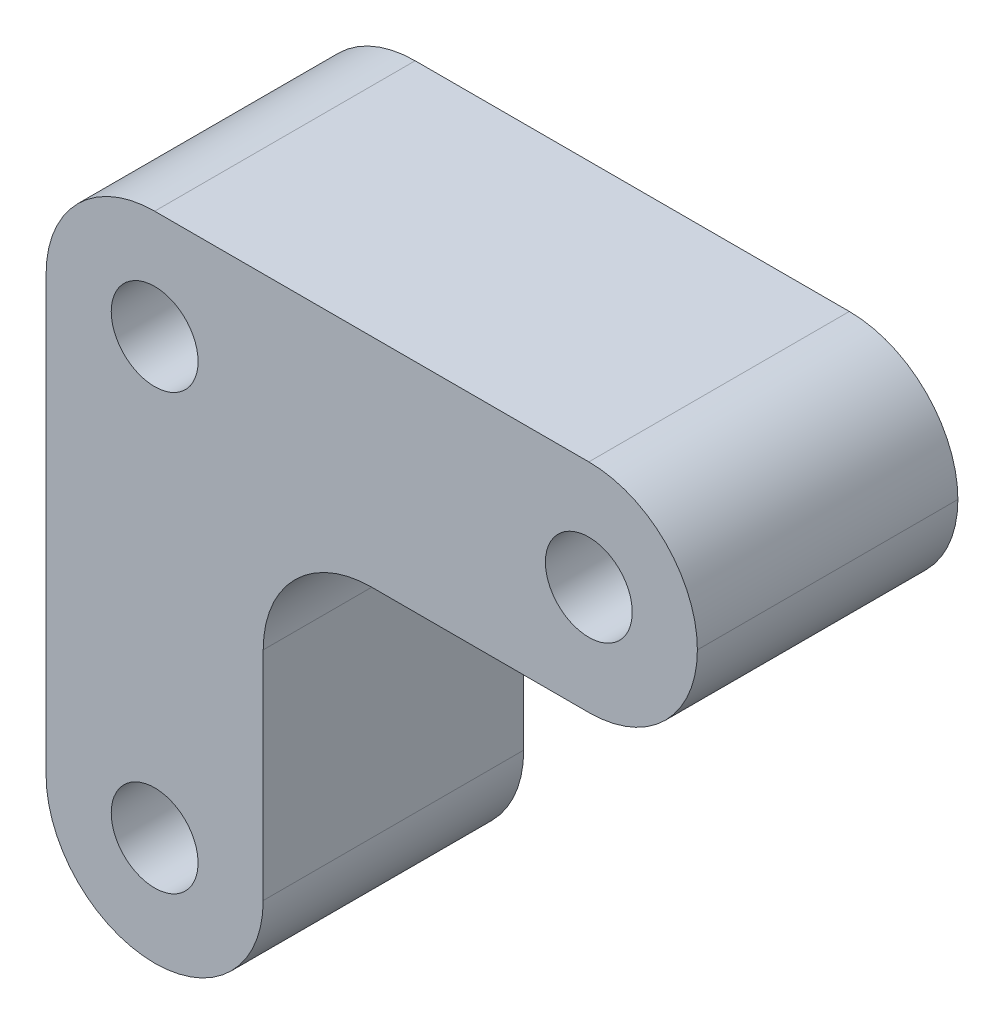
ISO-10303-21;
HEADER;
FILE_DESCRIPTION(('STEP AP214'),'2;1');
FILE_NAME('part.step','',(''),(''),'','','');
FILE_SCHEMA(('AUTOMOTIVE_DESIGN { 1 0 10303 214 1 1 1 1 }'));
ENDSEC;
DATA;
#1=APPLICATION_CONTEXT('core data for automotive mechanical design processes');
#2=APPLICATION_PROTOCOL_DEFINITION('international standard','automotive_design',2000,#1);
#3=PRODUCT_CONTEXT('',#1,'mechanical');
#4=PRODUCT('Part','Part','',(#3));
#5=PRODUCT_RELATED_PRODUCT_CATEGORY('part','',(#4));
#6=PRODUCT_DEFINITION_FORMATION('','',#4);
#7=PRODUCT_DEFINITION_CONTEXT('part definition',#1,'design');
#8=PRODUCT_DEFINITION('design','',#6,#7);
#9=PRODUCT_DEFINITION_SHAPE('','',#8);
#10=(LENGTH_UNIT() NAMED_UNIT(*) SI_UNIT(.MILLI.,.METRE.));
#11=(NAMED_UNIT(*) PLANE_ANGLE_UNIT() SI_UNIT($,.RADIAN.));
#12=(NAMED_UNIT(*) SI_UNIT($,.STERADIAN.) SOLID_ANGLE_UNIT());
#13=UNCERTAINTY_MEASURE_WITH_UNIT(LENGTH_MEASURE(1.E-05),#10,'distance_accuracy_value','');
#14=(GEOMETRIC_REPRESENTATION_CONTEXT(3) GLOBAL_UNCERTAINTY_ASSIGNED_CONTEXT((#13)) GLOBAL_UNIT_ASSIGNED_CONTEXT((#10,
#11,#12)) REPRESENTATION_CONTEXT('',''));
#15=CARTESIAN_POINT('',(0.,0.,0.));
#16=DIRECTION('',(0.,0.,1.));
#17=DIRECTION('',(1.,0.,0.));
#18=AXIS2_PLACEMENT_3D('',#15,#16,#17);
#19=CARTESIAN_POINT('',(0.,0.,12.));
#20=DIRECTION('',(1.,0.,0.));
#21=DIRECTION('',(0.,0.,-1.));
#22=AXIS2_PLACEMENT_3D('',#19,#20,#21);
#23=PLANE('',#22);
#24=DIRECTION('',(0.,-1.,0.));
#25=VECTOR('',#24,1.);
#26=CARTESIAN_POINT('',(0.,0.,12.));
#27=LINE('',#26,#25);
#28=CARTESIAN_POINT('',(0.,25.,12.));
#29=VERTEX_POINT('',#28);
#30=CARTESIAN_POINT('',(0.,5.,12.));
#31=VERTEX_POINT('',#30);
#32=EDGE_CURVE('E212',#29,#31,#27,.T.);
#33=ORIENTED_EDGE('',*,*,#32,.F.);
#34=DIRECTION('',(0.,0.,-1.));
#35=VECTOR('',#34,1.);
#36=CARTESIAN_POINT('',(0.,25.,12.));
#37=LINE('',#36,#35);
#38=CARTESIAN_POINT('',(0.,25.,0.));
#39=VERTEX_POINT('',#38);
#40=EDGE_CURVE('E145',#29,#39,#37,.T.);
#41=ORIENTED_EDGE('',*,*,#40,.T.);
#42=DIRECTION('',(0.,-1.,0.));
#43=VECTOR('',#42,1.);
#44=CARTESIAN_POINT('',(0.,0.,0.));
#45=LINE('',#44,#43);
#46=CARTESIAN_POINT('',(0.,5.,0.));
#47=VERTEX_POINT('',#46);
#48=EDGE_CURVE('E211',#39,#47,#45,.T.);
#49=ORIENTED_EDGE('',*,*,#48,.T.);
#50=DIRECTION('',(0.,0.,-1.));
#51=VECTOR('',#50,1.);
#52=CARTESIAN_POINT('',(0.,5.,12.));
#53=LINE('',#52,#51);
#54=EDGE_CURVE('E142',#47,#31,#53,.F.);
#55=ORIENTED_EDGE('',*,*,#54,.T.);
#56=EDGE_LOOP('',(#33,#41,#49,#55));
#57=FACE_BOUND('',#56,.T.);
#58=ADVANCED_FACE('F32',(#57),#23,.F.);
#59=CARTESIAN_POINT('',(0.,30.,12.));
#60=DIRECTION('',(0.,-1.,0.));
#61=DIRECTION('',(0.,0.,-1.));
#62=AXIS2_PLACEMENT_3D('',#59,#60,#61);
#63=PLANE('',#62);
#64=DIRECTION('',(-1.,0.,0.));
#65=VECTOR('',#64,1.);
#66=CARTESIAN_POINT('',(0.,30.,0.));
#67=LINE('',#66,#65);
#68=CARTESIAN_POINT('',(25.,30.,0.));
#69=VERTEX_POINT('',#68);
#70=CARTESIAN_POINT('',(5.,30.,0.));
#71=VERTEX_POINT('',#70);
#72=EDGE_CURVE('E214',#69,#71,#67,.T.);
#73=ORIENTED_EDGE('',*,*,#72,.T.);
#74=DIRECTION('',(0.,0.,-1.));
#75=VECTOR('',#74,1.);
#76=CARTESIAN_POINT('',(5.,30.,12.));
#77=LINE('',#76,#75);
#78=CARTESIAN_POINT('',(5.,30.,12.));
#79=VERTEX_POINT('',#78);
#80=EDGE_CURVE('E161',#71,#79,#77,.F.);
#81=ORIENTED_EDGE('',*,*,#80,.T.);
#82=DIRECTION('',(-1.,0.,0.));
#83=VECTOR('',#82,1.);
#84=CARTESIAN_POINT('',(0.,30.,12.));
#85=LINE('',#84,#83);
#86=CARTESIAN_POINT('',(25.,30.,12.));
#87=VERTEX_POINT('',#86);
#88=EDGE_CURVE('E137',#87,#79,#85,.T.);
#89=ORIENTED_EDGE('',*,*,#88,.F.);
#90=DIRECTION('',(0.,0.,-1.));
#91=VECTOR('',#90,1.);
#92=CARTESIAN_POINT('',(25.,30.,12.));
#93=LINE('',#92,#91);
#94=EDGE_CURVE('E158',#87,#69,#93,.T.);
#95=ORIENTED_EDGE('',*,*,#94,.T.);
#96=EDGE_LOOP('',(#73,#81,#89,#95));
#97=FACE_BOUND('',#96,.T.);
#98=ADVANCED_FACE('F221',(#97),#63,.F.);
#99=CARTESIAN_POINT('',(0.,0.,12.));
#100=DIRECTION('',(0.,0.,-1.));
#101=DIRECTION('',(-1.,0.,0.));
#102=AXIS2_PLACEMENT_3D('',#99,#100,#101);
#103=PLANE('',#102);
#104=CARTESIAN_POINT('',(25.,25.,12.));
#105=DIRECTION('',(0.,0.,-1.));
#106=DIRECTION('',(-1.,0.,0.));
#107=AXIS2_PLACEMENT_3D('',#104,#105,#106);
#108=CIRCLE('',#107,2.00000000000001);
#109=CARTESIAN_POINT('',(23.,25.,12.));
#110=VERTEX_POINT('',#109);
#111=EDGE_CURVE('E202',#110,#110,#108,.T.);
#112=ORIENTED_EDGE('',*,*,#111,.T.);
#113=EDGE_LOOP('',(#112));
#114=FACE_BOUND('',#113,.T.);
#115=CARTESIAN_POINT('',(4.99999999999999,5.,12.));
#116=DIRECTION('',(0.,0.,-1.));
#117=DIRECTION('',(-1.,0.,0.));
#118=AXIS2_PLACEMENT_3D('',#115,#116,#117);
#119=CIRCLE('',#118,2.);
#120=CARTESIAN_POINT('',(2.99999999999999,5.,12.));
#121=VERTEX_POINT('',#120);
#122=EDGE_CURVE('E197',#121,#121,#119,.T.);
#123=ORIENTED_EDGE('',*,*,#122,.T.);
#124=EDGE_LOOP('',(#123));
#125=FACE_BOUND('',#124,.T.);
#126=CARTESIAN_POINT('',(5.,25.,12.));
#127=DIRECTION('',(0.,0.,-1.));
#128=DIRECTION('',(-1.,0.,0.));
#129=AXIS2_PLACEMENT_3D('',#126,#127,#128);
#130=CIRCLE('',#129,2.);
#131=CARTESIAN_POINT('',(3.,25.,12.));
#132=VERTEX_POINT('',#131);
#133=EDGE_CURVE('E208',#132,#132,#130,.T.);
#134=ORIENTED_EDGE('',*,*,#133,.T.);
#135=EDGE_LOOP('',(#134));
#136=FACE_BOUND('',#135,.T.);
#137=ORIENTED_EDGE('',*,*,#88,.T.);
#138=CARTESIAN_POINT('',(5.,25.,12.));
#139=DIRECTION('',(0.,0.,-1.));
#140=DIRECTION('',(-1.,0.,0.));
#141=AXIS2_PLACEMENT_3D('',#138,#139,#140);
#142=CIRCLE('',#141,5.);
#143=EDGE_CURVE('E169',#79,#29,#142,.F.);
#144=ORIENTED_EDGE('',*,*,#143,.T.);
#145=ORIENTED_EDGE('',*,*,#32,.T.);
#146=CARTESIAN_POINT('',(5.,5.,12.));
#147=DIRECTION('',(0.,0.,-1.));
#148=DIRECTION('',(-1.,0.,0.));
#149=AXIS2_PLACEMENT_3D('',#146,#147,#148);
#150=CIRCLE('',#149,5.);
#151=CARTESIAN_POINT('',(5.,0.,12.));
#152=VERTEX_POINT('',#151);
#153=EDGE_CURVE('E56',#31,#152,#150,.F.);
#154=ORIENTED_EDGE('',*,*,#153,.T.);
#155=CARTESIAN_POINT('',(5.,5.,12.));
#156=DIRECTION('',(0.,0.,-1.));
#157=DIRECTION('',(-1.,0.,0.));
#158=AXIS2_PLACEMENT_3D('',#155,#156,#157);
#159=CIRCLE('',#158,5.);
#160=CARTESIAN_POINT('',(10.,5.,12.));
#161=VERTEX_POINT('',#160);
#162=EDGE_CURVE('E166',#152,#161,#159,.F.);
#163=ORIENTED_EDGE('',*,*,#162,.T.);
#164=DIRECTION('',(0.,1.,0.));
#165=VECTOR('',#164,1.);
#166=CARTESIAN_POINT('',(10.,0.,12.));
#167=LINE('',#166,#165);
#168=CARTESIAN_POINT('',(10.,15.,12.));
#169=VERTEX_POINT('',#168);
#170=EDGE_CURVE('E189',#161,#169,#167,.T.);
#171=ORIENTED_EDGE('',*,*,#170,.T.);
#172=CARTESIAN_POINT('',(15.,15.,12.));
#173=DIRECTION('',(0.,0.,-1.));
#174=DIRECTION('',(-1.,0.,0.));
#175=AXIS2_PLACEMENT_3D('',#172,#173,#174);
#176=CIRCLE('',#175,5.);
#177=CARTESIAN_POINT('',(15.,20.,12.));
#178=VERTEX_POINT('',#177);
#179=EDGE_CURVE('E41',#169,#178,#176,.T.);
#180=ORIENTED_EDGE('',*,*,#179,.T.);
#181=DIRECTION('',(1.,0.,0.));
#182=VECTOR('',#181,1.);
#183=CARTESIAN_POINT('',(0.,20.,12.));
#184=LINE('',#183,#182);
#185=CARTESIAN_POINT('',(25.,20.,12.));
#186=VERTEX_POINT('',#185);
#187=EDGE_CURVE('E130',#178,#186,#184,.T.);
#188=ORIENTED_EDGE('',*,*,#187,.T.);
#189=CARTESIAN_POINT('',(25.,25.,12.));
#190=DIRECTION('',(0.,0.,-1.));
#191=DIRECTION('',(-1.,0.,0.));
#192=AXIS2_PLACEMENT_3D('',#189,#190,#191);
#193=CIRCLE('',#192,5.);
#194=CARTESIAN_POINT('',(30.,25.,12.));
#195=VERTEX_POINT('',#194);
#196=EDGE_CURVE('E49',#186,#195,#193,.F.);
#197=ORIENTED_EDGE('',*,*,#196,.T.);
#198=CARTESIAN_POINT('',(25.,25.,12.));
#199=DIRECTION('',(0.,0.,-1.));
#200=DIRECTION('',(-1.,0.,0.));
#201=AXIS2_PLACEMENT_3D('',#198,#199,#200);
#202=CIRCLE('',#201,5.);
#203=EDGE_CURVE('E164',#195,#87,#202,.F.);
#204=ORIENTED_EDGE('',*,*,#203,.T.);
#205=EDGE_LOOP('',(#137,#144,#145,#154,#163,#171,#180,#188,#197,#204));
#206=FACE_BOUND('',#205,.T.);
#207=ADVANCED_FACE('F228',(#114,#125,#136,#206),#103,.F.);
#208=CARTESIAN_POINT('',(0.,0.,0.));
#209=DIRECTION('',(0.,0.,-1.));
#210=DIRECTION('',(-1.,0.,0.));
#211=AXIS2_PLACEMENT_3D('',#208,#209,#210);
#212=PLANE('',#211);
#213=ORIENTED_EDGE('',*,*,#48,.F.);
#214=CARTESIAN_POINT('',(5.,25.,0.));
#215=DIRECTION('',(0.,0.,-1.));
#216=DIRECTION('',(-1.,0.,0.));
#217=AXIS2_PLACEMENT_3D('',#214,#215,#216);
#218=CIRCLE('',#217,5.);
#219=EDGE_CURVE('E156',#39,#71,#218,.T.);
#220=ORIENTED_EDGE('',*,*,#219,.T.);
#221=ORIENTED_EDGE('',*,*,#72,.F.);
#222=CARTESIAN_POINT('',(25.,25.,0.));
#223=DIRECTION('',(0.,0.,-1.));
#224=DIRECTION('',(-1.,0.,0.));
#225=AXIS2_PLACEMENT_3D('',#222,#223,#224);
#226=CIRCLE('',#225,5.);
#227=CARTESIAN_POINT('',(30.,25.,0.));
#228=VERTEX_POINT('',#227);
#229=EDGE_CURVE('E150',#69,#228,#226,.T.);
#230=ORIENTED_EDGE('',*,*,#229,.T.);
#231=CARTESIAN_POINT('',(25.,25.,0.));
#232=DIRECTION('',(0.,0.,-1.));
#233=DIRECTION('',(-1.,0.,0.));
#234=AXIS2_PLACEMENT_3D('',#231,#232,#233);
#235=CIRCLE('',#234,5.);
#236=CARTESIAN_POINT('',(25.,20.,0.));
#237=VERTEX_POINT('',#236);
#238=EDGE_CURVE('E148',#228,#237,#235,.T.);
#239=ORIENTED_EDGE('',*,*,#238,.T.);
#240=DIRECTION('',(-1.,0.,0.));
#241=VECTOR('',#240,1.);
#242=CARTESIAN_POINT('',(30.,20.,0.));
#243=LINE('',#242,#241);
#244=CARTESIAN_POINT('',(15.,20.,0.));
#245=VERTEX_POINT('',#244);
#246=EDGE_CURVE('E118',#237,#245,#243,.T.);
#247=ORIENTED_EDGE('',*,*,#246,.T.);
#248=CARTESIAN_POINT('',(15.,15.,0.));
#249=DIRECTION('',(0.,0.,-1.));
#250=DIRECTION('',(-1.,0.,0.));
#251=AXIS2_PLACEMENT_3D('',#248,#249,#250);
#252=CIRCLE('',#251,5.);
#253=CARTESIAN_POINT('',(10.,15.,0.));
#254=VERTEX_POINT('',#253);
#255=EDGE_CURVE('E11',#245,#254,#252,.F.);
#256=ORIENTED_EDGE('',*,*,#255,.T.);
#257=DIRECTION('',(0.,-1.,0.));
#258=VECTOR('',#257,1.);
#259=CARTESIAN_POINT('',(10.,0.,0.));
#260=LINE('',#259,#258);
#261=CARTESIAN_POINT('',(10.,5.,0.));
#262=VERTEX_POINT('',#261);
#263=EDGE_CURVE('E115',#254,#262,#260,.T.);
#264=ORIENTED_EDGE('',*,*,#263,.T.);
#265=CARTESIAN_POINT('',(5.,5.,0.));
#266=DIRECTION('',(0.,0.,-1.));
#267=DIRECTION('',(-1.,0.,0.));
#268=AXIS2_PLACEMENT_3D('',#265,#266,#267);
#269=CIRCLE('',#268,5.);
#270=CARTESIAN_POINT('',(5.,0.,0.));
#271=VERTEX_POINT('',#270);
#272=EDGE_CURVE('E152',#262,#271,#269,.T.);
#273=ORIENTED_EDGE('',*,*,#272,.T.);
#274=CARTESIAN_POINT('',(5.,5.,0.));
#275=DIRECTION('',(0.,0.,-1.));
#276=DIRECTION('',(-1.,0.,0.));
#277=AXIS2_PLACEMENT_3D('',#274,#275,#276);
#278=CIRCLE('',#277,5.);
#279=EDGE_CURVE('E154',#271,#47,#278,.T.);
#280=ORIENTED_EDGE('',*,*,#279,.T.);
#281=EDGE_LOOP('',(#213,#220,#221,#230,#239,#247,#256,#264,#273,#280));
#282=FACE_BOUND('',#281,.T.);
#283=CARTESIAN_POINT('',(25.,25.,0.));
#284=DIRECTION('',(0.,0.,1.));
#285=DIRECTION('',(-1.,0.,0.));
#286=AXIS2_PLACEMENT_3D('',#283,#284,#285);
#287=CIRCLE('',#286,2.00000000000001);
#288=CARTESIAN_POINT('',(23.,25.,0.));
#289=VERTEX_POINT('',#288);
#290=EDGE_CURVE('E194',#289,#289,#287,.T.);
#291=ORIENTED_EDGE('',*,*,#290,.T.);
#292=EDGE_LOOP('',(#291));
#293=FACE_BOUND('',#292,.T.);
#294=CARTESIAN_POINT('',(4.99999999999999,5.,0.));
#295=DIRECTION('',(0.,0.,1.));
#296=DIRECTION('',(-1.,0.,0.));
#297=AXIS2_PLACEMENT_3D('',#294,#295,#296);
#298=CIRCLE('',#297,2.);
#299=CARTESIAN_POINT('',(2.99999999999999,5.,0.));
#300=VERTEX_POINT('',#299);
#301=EDGE_CURVE('E191',#300,#300,#298,.T.);
#302=ORIENTED_EDGE('',*,*,#301,.T.);
#303=EDGE_LOOP('',(#302));
#304=FACE_BOUND('',#303,.T.);
#305=CARTESIAN_POINT('',(5.,25.,0.));
#306=DIRECTION('',(0.,0.,1.));
#307=DIRECTION('',(1.,0.,0.));
#308=AXIS2_PLACEMENT_3D('',#305,#306,#307);
#309=CIRCLE('',#308,2.);
#310=CARTESIAN_POINT('',(7.,25.,0.));
#311=VERTEX_POINT('',#310);
#312=EDGE_CURVE('E205',#311,#311,#309,.T.);
#313=ORIENTED_EDGE('',*,*,#312,.T.);
#314=EDGE_LOOP('',(#313));
#315=FACE_BOUND('',#314,.T.);
#316=ADVANCED_FACE('F113',(#282,#293,#304,#315),#212,.T.);
#317=CARTESIAN_POINT('',(5.,25.,0.));
#318=DIRECTION('',(0.,0.,1.));
#319=DIRECTION('',(1.,0.,0.));
#320=AXIS2_PLACEMENT_3D('',#317,#318,#319);
#321=CYLINDRICAL_SURFACE('',#320,2.);
#322=ORIENTED_EDGE('',*,*,#312,.F.);
#323=EDGE_LOOP('',(#322));
#324=FACE_BOUND('',#323,.T.);
#325=ORIENTED_EDGE('',*,*,#133,.F.);
#326=EDGE_LOOP('',(#325));
#327=FACE_BOUND('',#326,.T.);
#328=ADVANCED_FACE('F267',(#324,#327),#321,.F.);
#329=CARTESIAN_POINT('',(4.99999999999999,5.,0.));
#330=DIRECTION('',(0.,0.,1.));
#331=DIRECTION('',(1.,0.,0.));
#332=AXIS2_PLACEMENT_3D('',#329,#330,#331);
#333=CYLINDRICAL_SURFACE('',#332,2.);
#334=ORIENTED_EDGE('',*,*,#301,.F.);
#335=EDGE_LOOP('',(#334));
#336=FACE_BOUND('',#335,.T.);
#337=ORIENTED_EDGE('',*,*,#122,.F.);
#338=EDGE_LOOP('',(#337));
#339=FACE_BOUND('',#338,.T.);
#340=ADVANCED_FACE('F263',(#336,#339),#333,.F.);
#341=CARTESIAN_POINT('',(25.,25.,0.));
#342=DIRECTION('',(0.,0.,1.));
#343=DIRECTION('',(1.,0.,0.));
#344=AXIS2_PLACEMENT_3D('',#341,#342,#343);
#345=CYLINDRICAL_SURFACE('',#344,2.00000000000001);
#346=ORIENTED_EDGE('',*,*,#290,.F.);
#347=EDGE_LOOP('',(#346));
#348=FACE_BOUND('',#347,.T.);
#349=ORIENTED_EDGE('',*,*,#111,.F.);
#350=EDGE_LOOP('',(#349));
#351=FACE_BOUND('',#350,.T.);
#352=ADVANCED_FACE('F258',(#348,#351),#345,.F.);
#353=CARTESIAN_POINT('',(10.,0.,0.));
#354=DIRECTION('',(-1.,0.,0.));
#355=DIRECTION('',(0.,-1.,0.));
#356=AXIS2_PLACEMENT_3D('',#353,#354,#355);
#357=PLANE('',#356);
#358=ORIENTED_EDGE('',*,*,#263,.F.);
#359=DIRECTION('',(0.,0.,1.));
#360=VECTOR('',#359,1.);
#361=CARTESIAN_POINT('',(10.,15.,12.));
#362=LINE('',#361,#360);
#363=EDGE_CURVE('E126',#254,#169,#362,.T.);
#364=ORIENTED_EDGE('',*,*,#363,.T.);
#365=ORIENTED_EDGE('',*,*,#170,.F.);
#366=DIRECTION('',(0.,0.,1.));
#367=VECTOR('',#366,1.);
#368=CARTESIAN_POINT('',(10.,5.,0.));
#369=LINE('',#368,#367);
#370=EDGE_CURVE('E129',#161,#262,#369,.F.);
#371=ORIENTED_EDGE('',*,*,#370,.T.);
#372=EDGE_LOOP('',(#358,#364,#365,#371));
#373=FACE_BOUND('',#372,.T.);
#374=ADVANCED_FACE('F124',(#373),#357,.F.);
#375=CARTESIAN_POINT('',(30.,20.,0.));
#376=DIRECTION('',(0.,1.,0.));
#377=DIRECTION('',(-1.,0.,0.));
#378=AXIS2_PLACEMENT_3D('',#375,#376,#377);
#379=PLANE('',#378);
#380=ORIENTED_EDGE('',*,*,#187,.F.);
#381=DIRECTION('',(0.,0.,1.));
#382=VECTOR('',#381,1.);
#383=CARTESIAN_POINT('',(15.,20.,0.));
#384=LINE('',#383,#382);
#385=EDGE_CURVE('E135',#178,#245,#384,.F.);
#386=ORIENTED_EDGE('',*,*,#385,.T.);
#387=ORIENTED_EDGE('',*,*,#246,.F.);
#388=DIRECTION('',(0.,0.,1.));
#389=VECTOR('',#388,1.);
#390=CARTESIAN_POINT('',(25.,20.,0.));
#391=LINE('',#390,#389);
#392=EDGE_CURVE('E133',#237,#186,#391,.T.);
#393=ORIENTED_EDGE('',*,*,#392,.T.);
#394=EDGE_LOOP('',(#380,#386,#387,#393));
#395=FACE_BOUND('',#394,.T.);
#396=ADVANCED_FACE('F188',(#395),#379,.F.);
#397=CARTESIAN_POINT('',(15.,15.,0.));
#398=DIRECTION('',(0.,0.,-1.));
#399=DIRECTION('',(-1.,0.,0.));
#400=AXIS2_PLACEMENT_3D('',#397,#398,#399);
#401=CYLINDRICAL_SURFACE('',#400,5.);
#402=ORIENTED_EDGE('',*,*,#255,.F.);
#403=ORIENTED_EDGE('',*,*,#385,.F.);
#404=ORIENTED_EDGE('',*,*,#179,.F.);
#405=ORIENTED_EDGE('',*,*,#363,.F.);
#406=EDGE_LOOP('',(#402,#403,#404,#405));
#407=FACE_BOUND('',#406,.T.);
#408=ADVANCED_FACE('F132',(#407),#401,.F.);
#409=CARTESIAN_POINT('',(5.,25.,12.));
#410=DIRECTION('',(0.,0.,-1.));
#411=DIRECTION('',(-1.,0.,0.));
#412=AXIS2_PLACEMENT_3D('',#409,#410,#411);
#413=CYLINDRICAL_SURFACE('',#412,5.);
#414=ORIENTED_EDGE('',*,*,#143,.F.);
#415=ORIENTED_EDGE('',*,*,#80,.F.);
#416=ORIENTED_EDGE('',*,*,#219,.F.);
#417=ORIENTED_EDGE('',*,*,#40,.F.);
#418=EDGE_LOOP('',(#414,#415,#416,#417));
#419=FACE_BOUND('',#418,.T.);
#420=ADVANCED_FACE('F225',(#419),#413,.T.);
#421=CARTESIAN_POINT('',(5.,5.,12.));
#422=DIRECTION('',(0.,0.,1.));
#423=DIRECTION('',(1.,0.,0.));
#424=AXIS2_PLACEMENT_3D('',#421,#422,#423);
#425=CYLINDRICAL_SURFACE('',#424,5.);
#426=ORIENTED_EDGE('',*,*,#370,.F.);
#427=ORIENTED_EDGE('',*,*,#162,.F.);
#428=DIRECTION('',(0.,0.,1.));
#429=VECTOR('',#428,1.);
#430=CARTESIAN_POINT('',(5.,0.,12.));
#431=LINE('',#430,#429);
#432=EDGE_CURVE('E171',#271,#152,#431,.T.);
#433=ORIENTED_EDGE('',*,*,#432,.F.);
#434=ORIENTED_EDGE('',*,*,#272,.F.);
#435=EDGE_LOOP('',(#426,#427,#433,#434));
#436=FACE_BOUND('',#435,.T.);
#437=ADVANCED_FACE('F233',(#436),#425,.T.);
#438=CARTESIAN_POINT('',(5.,5.,12.));
#439=DIRECTION('',(0.,0.,-1.));
#440=DIRECTION('',(-1.,0.,0.));
#441=AXIS2_PLACEMENT_3D('',#438,#439,#440);
#442=CYLINDRICAL_SURFACE('',#441,5.);
#443=ORIENTED_EDGE('',*,*,#153,.F.);
#444=ORIENTED_EDGE('',*,*,#54,.F.);
#445=ORIENTED_EDGE('',*,*,#279,.F.);
#446=ORIENTED_EDGE('',*,*,#432,.T.);
#447=EDGE_LOOP('',(#443,#444,#445,#446));
#448=FACE_BOUND('',#447,.T.);
#449=ADVANCED_FACE('F231',(#448),#442,.T.);
#450=CARTESIAN_POINT('',(25.,25.,0.));
#451=DIRECTION('',(0.,0.,1.));
#452=DIRECTION('',(1.,0.,0.));
#453=AXIS2_PLACEMENT_3D('',#450,#451,#452);
#454=CYLINDRICAL_SURFACE('',#453,5.);
#455=DIRECTION('',(0.,0.,1.));
#456=VECTOR('',#455,1.);
#457=CARTESIAN_POINT('',(30.,25.,12.));
#458=LINE('',#457,#456);
#459=EDGE_CURVE('E36',#195,#228,#458,.F.);
#460=ORIENTED_EDGE('',*,*,#459,.F.);
#461=ORIENTED_EDGE('',*,*,#196,.F.);
#462=ORIENTED_EDGE('',*,*,#392,.F.);
#463=ORIENTED_EDGE('',*,*,#238,.F.);
#464=EDGE_LOOP('',(#460,#461,#462,#463));
#465=FACE_BOUND('',#464,.T.);
#466=ADVANCED_FACE('F34',(#465),#454,.T.);
#467=CARTESIAN_POINT('',(25.,25.,12.));
#468=DIRECTION('',(0.,0.,-1.));
#469=DIRECTION('',(-1.,0.,0.));
#470=AXIS2_PLACEMENT_3D('',#467,#468,#469);
#471=CYLINDRICAL_SURFACE('',#470,5.);
#472=ORIENTED_EDGE('',*,*,#203,.F.);
#473=ORIENTED_EDGE('',*,*,#459,.T.);
#474=ORIENTED_EDGE('',*,*,#229,.F.);
#475=ORIENTED_EDGE('',*,*,#94,.F.);
#476=EDGE_LOOP('',(#472,#473,#474,#475));
#477=FACE_BOUND('',#476,.T.);
#478=ADVANCED_FACE('F180',(#477),#471,.T.);
#479=CLOSED_SHELL('',(#58,#98,#207,#316,#328,#340,#352,#374,#396,#408,#420,#437,#449,#466,#478));
#480=MANIFOLD_SOLID_BREP('B2',#479);
#481=ADVANCED_BREP_SHAPE_REPRESENTATION('',(#18,#480),#14);
#482=SHAPE_DEFINITION_REPRESENTATION(#9,#481);
ENDSEC;
END-ISO-10303-21;
